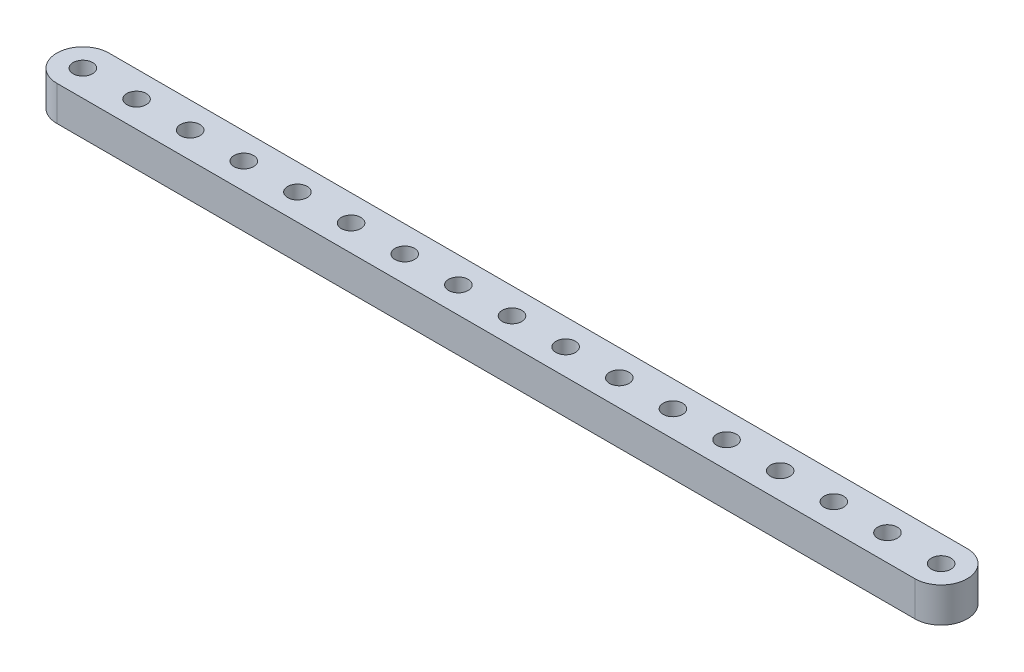
ISO-10303-21;
HEADER;
FILE_DESCRIPTION(('STEP AP214'),'2;1');
FILE_NAME('part.step','',(''),(''),'','','');
FILE_SCHEMA(('AUTOMOTIVE_DESIGN { 1 0 10303 214 1 1 1 1 }'));
ENDSEC;
DATA;
#1=APPLICATION_CONTEXT('core data for automotive mechanical design processes');
#2=APPLICATION_PROTOCOL_DEFINITION('international standard','automotive_design',2000,#1);
#3=PRODUCT_CONTEXT('',#1,'mechanical');
#4=PRODUCT('Part','Part','',(#3));
#5=PRODUCT_RELATED_PRODUCT_CATEGORY('part','',(#4));
#6=PRODUCT_DEFINITION_FORMATION('','',#4);
#7=PRODUCT_DEFINITION_CONTEXT('part definition',#1,'design');
#8=PRODUCT_DEFINITION('design','',#6,#7);
#9=PRODUCT_DEFINITION_SHAPE('','',#8);
#10=(LENGTH_UNIT() NAMED_UNIT(*) SI_UNIT(.MILLI.,.METRE.));
#11=(NAMED_UNIT(*) PLANE_ANGLE_UNIT() SI_UNIT($,.RADIAN.));
#12=(NAMED_UNIT(*) SI_UNIT($,.STERADIAN.) SOLID_ANGLE_UNIT());
#13=UNCERTAINTY_MEASURE_WITH_UNIT(LENGTH_MEASURE(1.E-05),#10,'distance_accuracy_value','');
#14=(GEOMETRIC_REPRESENTATION_CONTEXT(3) GLOBAL_UNCERTAINTY_ASSIGNED_CONTEXT((#13)) GLOBAL_UNIT_ASSIGNED_CONTEXT((#10,
#11,#12)) REPRESENTATION_CONTEXT('',''));
#15=CARTESIAN_POINT('',(0.,0.,0.));
#16=DIRECTION('',(0.,0.,1.));
#17=DIRECTION('',(1.,0.,0.));
#18=AXIS2_PLACEMENT_3D('',#15,#16,#17);
#19=CARTESIAN_POINT('',(78.232,0.,0.));
#20=DIRECTION('',(0.,1.,0.));
#21=DIRECTION('',(0.,0.,1.));
#22=AXIS2_PLACEMENT_3D('',#19,#20,#21);
#23=CYLINDRICAL_SURFACE('',#22,4.76250000000002);
#24=CARTESIAN_POINT('',(78.232,6.35,0.));
#25=DIRECTION('',(0.,1.,0.));
#26=DIRECTION('',(0.,0.,1.));
#27=AXIS2_PLACEMENT_3D('',#24,#25,#26);
#28=CIRCLE('',#27,4.76250000000002);
#29=CARTESIAN_POINT('',(78.232,6.35,4.76250000000002));
#30=VERTEX_POINT('',#29);
#31=CARTESIAN_POINT('',(78.232,6.35,-4.76250000000002));
#32=VERTEX_POINT('',#31);
#33=EDGE_CURVE('E98',#30,#32,#28,.T.);
#34=ORIENTED_EDGE('',*,*,#33,.F.);
#35=DIRECTION('',(0.,1.,0.));
#36=VECTOR('',#35,1.);
#37=CARTESIAN_POINT('',(78.232,0.,4.76250000000002));
#38=LINE('',#37,#36);
#39=CARTESIAN_POINT('',(78.232,0.,4.76250000000002));
#40=VERTEX_POINT('',#39);
#41=EDGE_CURVE('E11',#40,#30,#38,.T.);
#42=ORIENTED_EDGE('',*,*,#41,.F.);
#43=CARTESIAN_POINT('',(78.232,0.,0.));
#44=DIRECTION('',(0.,1.,0.));
#45=DIRECTION('',(0.,0.,1.));
#46=AXIS2_PLACEMENT_3D('',#43,#44,#45);
#47=CIRCLE('',#46,4.76250000000002);
#48=CARTESIAN_POINT('',(78.232,0.,-4.76250000000002));
#49=VERTEX_POINT('',#48);
#50=EDGE_CURVE('E91',#40,#49,#47,.T.);
#51=ORIENTED_EDGE('',*,*,#50,.T.);
#52=DIRECTION('',(0.,1.,0.));
#53=VECTOR('',#52,1.);
#54=CARTESIAN_POINT('',(78.232,0.,-4.76250000000002));
#55=LINE('',#54,#53);
#56=EDGE_CURVE('E36',#49,#32,#55,.T.);
#57=ORIENTED_EDGE('',*,*,#56,.T.);
#58=EDGE_LOOP('',(#34,#42,#51,#57));
#59=FACE_BOUND('',#58,.T.);
#60=ADVANCED_FACE('F33',(#59),#23,.T.);
#61=CARTESIAN_POINT('',(-78.232,0.,4.76250000000002));
#62=DIRECTION('',(0.,0.,1.));
#63=DIRECTION('',(1.,0.,0.));
#64=AXIS2_PLACEMENT_3D('',#61,#62,#63);
#65=PLANE('',#64);
#66=DIRECTION('',(1.,0.,0.));
#67=VECTOR('',#66,1.);
#68=CARTESIAN_POINT('',(-78.232,6.35,4.76250000000002));
#69=LINE('',#68,#67);
#70=CARTESIAN_POINT('',(-78.232,6.35,4.76250000000002));
#71=VERTEX_POINT('',#70);
#72=EDGE_CURVE('E93',#71,#30,#69,.T.);
#73=ORIENTED_EDGE('',*,*,#72,.F.);
#74=DIRECTION('',(0.,1.,0.));
#75=VECTOR('',#74,1.);
#76=CARTESIAN_POINT('',(-78.232,0.,4.76250000000002));
#77=LINE('',#76,#75);
#78=CARTESIAN_POINT('',(-78.232,0.,4.76250000000002));
#79=VERTEX_POINT('',#78);
#80=EDGE_CURVE('E42',#79,#71,#77,.T.);
#81=ORIENTED_EDGE('',*,*,#80,.F.);
#82=DIRECTION('',(1.,0.,0.));
#83=VECTOR('',#82,1.);
#84=CARTESIAN_POINT('',(-78.232,0.,4.76250000000002));
#85=LINE('',#84,#83);
#86=EDGE_CURVE('E88',#79,#40,#85,.T.);
#87=ORIENTED_EDGE('',*,*,#86,.T.);
#88=ORIENTED_EDGE('',*,*,#41,.T.);
#89=EDGE_LOOP('',(#73,#81,#87,#88));
#90=FACE_BOUND('',#89,.T.);
#91=ADVANCED_FACE('F109',(#90),#65,.T.);
#92=CARTESIAN_POINT('',(-78.232,0.,0.));
#93=DIRECTION('',(0.,1.,0.));
#94=DIRECTION('',(0.,0.,1.));
#95=AXIS2_PLACEMENT_3D('',#92,#93,#94);
#96=CYLINDRICAL_SURFACE('',#95,4.76250000000001);
#97=CARTESIAN_POINT('',(-78.232,6.35,0.));
#98=DIRECTION('',(0.,1.,0.));
#99=DIRECTION('',(0.,0.,1.));
#100=AXIS2_PLACEMENT_3D('',#97,#98,#99);
#101=CIRCLE('',#100,4.76250000000001);
#102=CARTESIAN_POINT('',(-78.232,6.35,-4.7625));
#103=VERTEX_POINT('',#102);
#104=EDGE_CURVE('E83',#103,#71,#101,.T.);
#105=ORIENTED_EDGE('',*,*,#104,.F.);
#106=DIRECTION('',(0.,1.,0.));
#107=VECTOR('',#106,1.);
#108=CARTESIAN_POINT('',(-78.232,0.,-4.7625));
#109=LINE('',#108,#107);
#110=CARTESIAN_POINT('',(-78.232,0.,-4.7625));
#111=VERTEX_POINT('',#110);
#112=EDGE_CURVE('E78',#111,#103,#109,.T.);
#113=ORIENTED_EDGE('',*,*,#112,.F.);
#114=CARTESIAN_POINT('',(-78.232,0.,0.));
#115=DIRECTION('',(0.,1.,0.));
#116=DIRECTION('',(0.,0.,1.));
#117=AXIS2_PLACEMENT_3D('',#114,#115,#116);
#118=CIRCLE('',#117,4.76250000000001);
#119=EDGE_CURVE('E81',#111,#79,#118,.T.);
#120=ORIENTED_EDGE('',*,*,#119,.T.);
#121=ORIENTED_EDGE('',*,*,#80,.T.);
#122=EDGE_LOOP('',(#105,#113,#120,#121));
#123=FACE_BOUND('',#122,.T.);
#124=ADVANCED_FACE('F80',(#123),#96,.T.);
#125=CARTESIAN_POINT('',(78.232,0.,-4.76250000000002));
#126=DIRECTION('',(0.,0.,-1.));
#127=DIRECTION('',(-1.,0.,0.));
#128=AXIS2_PLACEMENT_3D('',#125,#126,#127);
#129=PLANE('',#128);
#130=DIRECTION('',(-1.,0.,0.));
#131=VECTOR('',#130,1.);
#132=CARTESIAN_POINT('',(78.232,6.35,-4.76250000000002));
#133=LINE('',#132,#131);
#134=EDGE_CURVE('E101',#32,#103,#133,.T.);
#135=ORIENTED_EDGE('',*,*,#134,.F.);
#136=ORIENTED_EDGE('',*,*,#56,.F.);
#137=DIRECTION('',(-1.,0.,0.));
#138=VECTOR('',#137,1.);
#139=CARTESIAN_POINT('',(78.232,0.,-4.76250000000002));
#140=LINE('',#139,#138);
#141=EDGE_CURVE('E87',#49,#111,#140,.T.);
#142=ORIENTED_EDGE('',*,*,#141,.T.);
#143=ORIENTED_EDGE('',*,*,#112,.T.);
#144=EDGE_LOOP('',(#135,#136,#142,#143));
#145=FACE_BOUND('',#144,.T.);
#146=ADVANCED_FACE('F90',(#145),#129,.T.);
#147=CARTESIAN_POINT('',(78.232,0.,0.));
#148=DIRECTION('',(0.,1.,0.));
#149=DIRECTION('',(0.,0.,1.));
#150=AXIS2_PLACEMENT_3D('',#147,#148,#149);
#151=PLANE('',#150);
#152=CARTESIAN_POINT('',(-78.232,0.,0.));
#153=DIRECTION('',(0.,1.,0.));
#154=DIRECTION('',(0.,0.,-1.));
#155=AXIS2_PLACEMENT_3D('',#152,#153,#154);
#156=CIRCLE('',#155,1.77799999999997);
#157=CARTESIAN_POINT('',(-78.232,0.,-1.77799999999996));
#158=VERTEX_POINT('',#157);
#159=EDGE_CURVE('E202',#158,#158,#156,.T.);
#160=ORIENTED_EDGE('',*,*,#159,.T.);
#161=EDGE_LOOP('',(#160));
#162=FACE_BOUND('',#161,.T.);
#163=CARTESIAN_POINT('',(-68.453,0.,0.));
#164=DIRECTION('',(0.,1.,0.));
#165=DIRECTION('',(0.,0.,-1.));
#166=AXIS2_PLACEMENT_3D('',#163,#164,#165);
#167=CIRCLE('',#166,1.77799999999999);
#168=CARTESIAN_POINT('',(-68.453,0.,-1.77799999999999));
#169=VERTEX_POINT('',#168);
#170=EDGE_CURVE('E210',#169,#169,#167,.T.);
#171=ORIENTED_EDGE('',*,*,#170,.T.);
#172=EDGE_LOOP('',(#171));
#173=FACE_BOUND('',#172,.T.);
#174=CARTESIAN_POINT('',(-58.674,0.,0.));
#175=DIRECTION('',(0.,1.,0.));
#176=DIRECTION('',(0.,0.,-1.));
#177=AXIS2_PLACEMENT_3D('',#174,#175,#176);
#178=CIRCLE('',#177,1.77799999999999);
#179=CARTESIAN_POINT('',(-58.674,0.,-1.77799999999999));
#180=VERTEX_POINT('',#179);
#181=EDGE_CURVE('E216',#180,#180,#178,.T.);
#182=ORIENTED_EDGE('',*,*,#181,.T.);
#183=EDGE_LOOP('',(#182));
#184=FACE_BOUND('',#183,.T.);
#185=CARTESIAN_POINT('',(-48.895,0.,0.));
#186=DIRECTION('',(0.,1.,0.));
#187=DIRECTION('',(0.,0.,-1.));
#188=AXIS2_PLACEMENT_3D('',#185,#186,#187);
#189=CIRCLE('',#188,1.77799999999999);
#190=CARTESIAN_POINT('',(-48.895,0.,-1.77799999999999));
#191=VERTEX_POINT('',#190);
#192=EDGE_CURVE('E222',#191,#191,#189,.T.);
#193=ORIENTED_EDGE('',*,*,#192,.T.);
#194=EDGE_LOOP('',(#193));
#195=FACE_BOUND('',#194,.T.);
#196=CARTESIAN_POINT('',(-39.116,0.,0.));
#197=DIRECTION('',(0.,1.,0.));
#198=DIRECTION('',(0.,0.,-1.));
#199=AXIS2_PLACEMENT_3D('',#196,#197,#198);
#200=CIRCLE('',#199,1.77799999999999);
#201=CARTESIAN_POINT('',(-39.116,0.,-1.77799999999999));
#202=VERTEX_POINT('',#201);
#203=EDGE_CURVE('E228',#202,#202,#200,.T.);
#204=ORIENTED_EDGE('',*,*,#203,.T.);
#205=EDGE_LOOP('',(#204));
#206=FACE_BOUND('',#205,.T.);
#207=CARTESIAN_POINT('',(-29.337,0.,0.));
#208=DIRECTION('',(0.,1.,0.));
#209=DIRECTION('',(0.,0.,-1.));
#210=AXIS2_PLACEMENT_3D('',#207,#208,#209);
#211=CIRCLE('',#210,1.77799999999999);
#212=CARTESIAN_POINT('',(-29.337,0.,-1.77799999999998));
#213=VERTEX_POINT('',#212);
#214=EDGE_CURVE('E234',#213,#213,#211,.T.);
#215=ORIENTED_EDGE('',*,*,#214,.T.);
#216=EDGE_LOOP('',(#215));
#217=FACE_BOUND('',#216,.T.);
#218=CARTESIAN_POINT('',(-19.558,0.,0.));
#219=DIRECTION('',(0.,1.,0.));
#220=DIRECTION('',(0.,0.,-1.));
#221=AXIS2_PLACEMENT_3D('',#218,#219,#220);
#222=CIRCLE('',#221,1.77799999999999);
#223=CARTESIAN_POINT('',(-19.558,0.,-1.77799999999998));
#224=VERTEX_POINT('',#223);
#225=EDGE_CURVE('E240',#224,#224,#222,.T.);
#226=ORIENTED_EDGE('',*,*,#225,.T.);
#227=EDGE_LOOP('',(#226));
#228=FACE_BOUND('',#227,.T.);
#229=CARTESIAN_POINT('',(-9.77900000000001,0.,0.));
#230=DIRECTION('',(0.,1.,0.));
#231=DIRECTION('',(0.,0.,-1.));
#232=AXIS2_PLACEMENT_3D('',#229,#230,#231);
#233=CIRCLE('',#232,1.77799999999999);
#234=CARTESIAN_POINT('',(-9.77900000000001,0.,-1.77799999999998));
#235=VERTEX_POINT('',#234);
#236=EDGE_CURVE('E246',#235,#235,#233,.T.);
#237=ORIENTED_EDGE('',*,*,#236,.T.);
#238=EDGE_LOOP('',(#237));
#239=FACE_BOUND('',#238,.T.);
#240=CARTESIAN_POINT('',(0.,0.,0.));
#241=DIRECTION('',(0.,1.,0.));
#242=DIRECTION('',(0.,0.,-1.));
#243=AXIS2_PLACEMENT_3D('',#240,#241,#242);
#244=CIRCLE('',#243,1.77799999999999);
#245=CARTESIAN_POINT('',(0.,0.,-1.77799999999998));
#246=VERTEX_POINT('',#245);
#247=EDGE_CURVE('E252',#246,#246,#244,.T.);
#248=ORIENTED_EDGE('',*,*,#247,.T.);
#249=EDGE_LOOP('',(#248));
#250=FACE_BOUND('',#249,.T.);
#251=CARTESIAN_POINT('',(9.77899999999998,0.,0.));
#252=DIRECTION('',(0.,1.,0.));
#253=DIRECTION('',(0.,0.,-1.));
#254=AXIS2_PLACEMENT_3D('',#251,#252,#253);
#255=CIRCLE('',#254,1.77799999999999);
#256=CARTESIAN_POINT('',(9.77899999999998,0.,-1.77799999999998));
#257=VERTEX_POINT('',#256);
#258=EDGE_CURVE('E258',#257,#257,#255,.T.);
#259=ORIENTED_EDGE('',*,*,#258,.T.);
#260=EDGE_LOOP('',(#259));
#261=FACE_BOUND('',#260,.T.);
#262=CARTESIAN_POINT('',(19.558,0.,0.));
#263=DIRECTION('',(0.,1.,0.));
#264=DIRECTION('',(0.,0.,-1.));
#265=AXIS2_PLACEMENT_3D('',#262,#263,#264);
#266=CIRCLE('',#265,1.77799999999999);
#267=CARTESIAN_POINT('',(19.558,0.,-1.77799999999998));
#268=VERTEX_POINT('',#267);
#269=EDGE_CURVE('E264',#268,#268,#266,.T.);
#270=ORIENTED_EDGE('',*,*,#269,.T.);
#271=EDGE_LOOP('',(#270));
#272=FACE_BOUND('',#271,.T.);
#273=CARTESIAN_POINT('',(29.337,0.,0.));
#274=DIRECTION('',(0.,1.,0.));
#275=DIRECTION('',(0.,0.,-1.));
#276=AXIS2_PLACEMENT_3D('',#273,#274,#275);
#277=CIRCLE('',#276,1.77799999999999);
#278=CARTESIAN_POINT('',(29.337,0.,-1.77799999999998));
#279=VERTEX_POINT('',#278);
#280=EDGE_CURVE('E270',#279,#279,#277,.T.);
#281=ORIENTED_EDGE('',*,*,#280,.T.);
#282=EDGE_LOOP('',(#281));
#283=FACE_BOUND('',#282,.T.);
#284=CARTESIAN_POINT('',(39.116,0.,0.));
#285=DIRECTION('',(0.,1.,0.));
#286=DIRECTION('',(0.,0.,-1.));
#287=AXIS2_PLACEMENT_3D('',#284,#285,#286);
#288=CIRCLE('',#287,1.77799999999999);
#289=CARTESIAN_POINT('',(39.116,0.,-1.77799999999998));
#290=VERTEX_POINT('',#289);
#291=EDGE_CURVE('E276',#290,#290,#288,.T.);
#292=ORIENTED_EDGE('',*,*,#291,.T.);
#293=EDGE_LOOP('',(#292));
#294=FACE_BOUND('',#293,.T.);
#295=CARTESIAN_POINT('',(48.895,0.,0.));
#296=DIRECTION('',(0.,1.,0.));
#297=DIRECTION('',(0.,0.,-1.));
#298=AXIS2_PLACEMENT_3D('',#295,#296,#297);
#299=CIRCLE('',#298,1.77799999999999);
#300=CARTESIAN_POINT('',(48.895,0.,-1.77799999999998));
#301=VERTEX_POINT('',#300);
#302=EDGE_CURVE('E282',#301,#301,#299,.T.);
#303=ORIENTED_EDGE('',*,*,#302,.T.);
#304=EDGE_LOOP('',(#303));
#305=FACE_BOUND('',#304,.T.);
#306=CARTESIAN_POINT('',(58.674,0.,0.));
#307=DIRECTION('',(0.,1.,0.));
#308=DIRECTION('',(0.,0.,-1.));
#309=AXIS2_PLACEMENT_3D('',#306,#307,#308);
#310=CIRCLE('',#309,1.77799999999999);
#311=CARTESIAN_POINT('',(58.674,0.,-1.77799999999998));
#312=VERTEX_POINT('',#311);
#313=EDGE_CURVE('E288',#312,#312,#310,.T.);
#314=ORIENTED_EDGE('',*,*,#313,.T.);
#315=EDGE_LOOP('',(#314));
#316=FACE_BOUND('',#315,.T.);
#317=CARTESIAN_POINT('',(68.453,0.,0.));
#318=DIRECTION('',(0.,1.,0.));
#319=DIRECTION('',(0.,0.,-1.));
#320=AXIS2_PLACEMENT_3D('',#317,#318,#319);
#321=CIRCLE('',#320,1.77799999999999);
#322=CARTESIAN_POINT('',(68.453,0.,-1.77799999999997));
#323=VERTEX_POINT('',#322);
#324=EDGE_CURVE('E294',#323,#323,#321,.T.);
#325=ORIENTED_EDGE('',*,*,#324,.T.);
#326=EDGE_LOOP('',(#325));
#327=FACE_BOUND('',#326,.T.);
#328=CARTESIAN_POINT('',(78.232,0.,0.));
#329=DIRECTION('',(0.,1.,0.));
#330=DIRECTION('',(0.,0.,-1.));
#331=AXIS2_PLACEMENT_3D('',#328,#329,#330);
#332=CIRCLE('',#331,1.77799999999999);
#333=CARTESIAN_POINT('',(78.232,0.,-1.77799999999997));
#334=VERTEX_POINT('',#333);
#335=EDGE_CURVE('E102',#334,#334,#332,.T.);
#336=ORIENTED_EDGE('',*,*,#335,.T.);
#337=EDGE_LOOP('',(#336));
#338=FACE_BOUND('',#337,.T.);
#339=ORIENTED_EDGE('',*,*,#50,.F.);
#340=ORIENTED_EDGE('',*,*,#86,.F.);
#341=ORIENTED_EDGE('',*,*,#119,.F.);
#342=ORIENTED_EDGE('',*,*,#141,.F.);
#343=EDGE_LOOP('',(#339,#340,#341,#342));
#344=FACE_BOUND('',#343,.T.);
#345=ADVANCED_FACE('F86',(#162,#173,#184,#195,#206,#217,#228,#239,#250,#261,#272,#283,#294,#305,
#316,#327,#338,#344),#151,.F.);
#346=CARTESIAN_POINT('',(78.232,6.35,0.));
#347=DIRECTION('',(0.,1.,0.));
#348=DIRECTION('',(0.,0.,1.));
#349=AXIS2_PLACEMENT_3D('',#346,#347,#348);
#350=PLANE('',#349);
#351=CARTESIAN_POINT('',(-78.232,6.35,0.));
#352=DIRECTION('',(0.,1.,0.));
#353=DIRECTION('',(0.,0.,-1.));
#354=AXIS2_PLACEMENT_3D('',#351,#352,#353);
#355=CIRCLE('',#354,1.77799999999997);
#356=CARTESIAN_POINT('',(-78.232,6.35,-1.77799999999996));
#357=VERTEX_POINT('',#356);
#358=EDGE_CURVE('E205',#357,#357,#355,.T.);
#359=ORIENTED_EDGE('',*,*,#358,.F.);
#360=EDGE_LOOP('',(#359));
#361=FACE_BOUND('',#360,.T.);
#362=CARTESIAN_POINT('',(-68.453,6.35,0.));
#363=DIRECTION('',(0.,1.,0.));
#364=DIRECTION('',(0.,0.,-1.));
#365=AXIS2_PLACEMENT_3D('',#362,#363,#364);
#366=CIRCLE('',#365,1.77799999999999);
#367=CARTESIAN_POINT('',(-68.453,6.35,-1.77799999999999));
#368=VERTEX_POINT('',#367);
#369=EDGE_CURVE('E207',#368,#368,#366,.T.);
#370=ORIENTED_EDGE('',*,*,#369,.F.);
#371=EDGE_LOOP('',(#370));
#372=FACE_BOUND('',#371,.T.);
#373=CARTESIAN_POINT('',(-58.674,6.35,0.));
#374=DIRECTION('',(0.,1.,0.));
#375=DIRECTION('',(0.,0.,-1.));
#376=AXIS2_PLACEMENT_3D('',#373,#374,#375);
#377=CIRCLE('',#376,1.77799999999999);
#378=CARTESIAN_POINT('',(-58.674,6.35,-1.77799999999999));
#379=VERTEX_POINT('',#378);
#380=EDGE_CURVE('E213',#379,#379,#377,.T.);
#381=ORIENTED_EDGE('',*,*,#380,.F.);
#382=EDGE_LOOP('',(#381));
#383=FACE_BOUND('',#382,.T.);
#384=CARTESIAN_POINT('',(-48.895,6.35,0.));
#385=DIRECTION('',(0.,1.,0.));
#386=DIRECTION('',(0.,0.,-1.));
#387=AXIS2_PLACEMENT_3D('',#384,#385,#386);
#388=CIRCLE('',#387,1.77799999999999);
#389=CARTESIAN_POINT('',(-48.895,6.35,-1.77799999999999));
#390=VERTEX_POINT('',#389);
#391=EDGE_CURVE('E219',#390,#390,#388,.T.);
#392=ORIENTED_EDGE('',*,*,#391,.F.);
#393=EDGE_LOOP('',(#392));
#394=FACE_BOUND('',#393,.T.);
#395=CARTESIAN_POINT('',(-39.116,6.35,0.));
#396=DIRECTION('',(0.,1.,0.));
#397=DIRECTION('',(0.,0.,-1.));
#398=AXIS2_PLACEMENT_3D('',#395,#396,#397);
#399=CIRCLE('',#398,1.77799999999999);
#400=CARTESIAN_POINT('',(-39.116,6.35,-1.77799999999999));
#401=VERTEX_POINT('',#400);
#402=EDGE_CURVE('E225',#401,#401,#399,.T.);
#403=ORIENTED_EDGE('',*,*,#402,.F.);
#404=EDGE_LOOP('',(#403));
#405=FACE_BOUND('',#404,.T.);
#406=CARTESIAN_POINT('',(-29.337,6.35,0.));
#407=DIRECTION('',(0.,1.,0.));
#408=DIRECTION('',(0.,0.,-1.));
#409=AXIS2_PLACEMENT_3D('',#406,#407,#408);
#410=CIRCLE('',#409,1.77799999999999);
#411=CARTESIAN_POINT('',(-29.337,6.35,-1.77799999999998));
#412=VERTEX_POINT('',#411);
#413=EDGE_CURVE('E231',#412,#412,#410,.T.);
#414=ORIENTED_EDGE('',*,*,#413,.F.);
#415=EDGE_LOOP('',(#414));
#416=FACE_BOUND('',#415,.T.);
#417=CARTESIAN_POINT('',(-19.558,6.35,0.));
#418=DIRECTION('',(0.,1.,0.));
#419=DIRECTION('',(0.,0.,-1.));
#420=AXIS2_PLACEMENT_3D('',#417,#418,#419);
#421=CIRCLE('',#420,1.77799999999999);
#422=CARTESIAN_POINT('',(-19.558,6.35,-1.77799999999998));
#423=VERTEX_POINT('',#422);
#424=EDGE_CURVE('E237',#423,#423,#421,.T.);
#425=ORIENTED_EDGE('',*,*,#424,.F.);
#426=EDGE_LOOP('',(#425));
#427=FACE_BOUND('',#426,.T.);
#428=CARTESIAN_POINT('',(-9.77900000000001,6.35,0.));
#429=DIRECTION('',(0.,1.,0.));
#430=DIRECTION('',(0.,0.,-1.));
#431=AXIS2_PLACEMENT_3D('',#428,#429,#430);
#432=CIRCLE('',#431,1.77799999999999);
#433=CARTESIAN_POINT('',(-9.77900000000001,6.35,-1.77799999999998));
#434=VERTEX_POINT('',#433);
#435=EDGE_CURVE('E243',#434,#434,#432,.T.);
#436=ORIENTED_EDGE('',*,*,#435,.F.);
#437=EDGE_LOOP('',(#436));
#438=FACE_BOUND('',#437,.T.);
#439=CARTESIAN_POINT('',(0.,6.35,0.));
#440=DIRECTION('',(0.,1.,0.));
#441=DIRECTION('',(0.,0.,-1.));
#442=AXIS2_PLACEMENT_3D('',#439,#440,#441);
#443=CIRCLE('',#442,1.77799999999999);
#444=CARTESIAN_POINT('',(0.,6.35,-1.77799999999998));
#445=VERTEX_POINT('',#444);
#446=EDGE_CURVE('E249',#445,#445,#443,.T.);
#447=ORIENTED_EDGE('',*,*,#446,.F.);
#448=EDGE_LOOP('',(#447));
#449=FACE_BOUND('',#448,.T.);
#450=CARTESIAN_POINT('',(9.77899999999998,6.35,0.));
#451=DIRECTION('',(0.,1.,0.));
#452=DIRECTION('',(0.,0.,-1.));
#453=AXIS2_PLACEMENT_3D('',#450,#451,#452);
#454=CIRCLE('',#453,1.77799999999999);
#455=CARTESIAN_POINT('',(9.77899999999998,6.35,-1.77799999999998));
#456=VERTEX_POINT('',#455);
#457=EDGE_CURVE('E255',#456,#456,#454,.T.);
#458=ORIENTED_EDGE('',*,*,#457,.F.);
#459=EDGE_LOOP('',(#458));
#460=FACE_BOUND('',#459,.T.);
#461=CARTESIAN_POINT('',(19.558,6.35,0.));
#462=DIRECTION('',(0.,1.,0.));
#463=DIRECTION('',(0.,0.,-1.));
#464=AXIS2_PLACEMENT_3D('',#461,#462,#463);
#465=CIRCLE('',#464,1.77799999999999);
#466=CARTESIAN_POINT('',(19.558,6.35,-1.77799999999998));
#467=VERTEX_POINT('',#466);
#468=EDGE_CURVE('E261',#467,#467,#465,.T.);
#469=ORIENTED_EDGE('',*,*,#468,.F.);
#470=EDGE_LOOP('',(#469));
#471=FACE_BOUND('',#470,.T.);
#472=CARTESIAN_POINT('',(29.337,6.35,0.));
#473=DIRECTION('',(0.,1.,0.));
#474=DIRECTION('',(0.,0.,-1.));
#475=AXIS2_PLACEMENT_3D('',#472,#473,#474);
#476=CIRCLE('',#475,1.77799999999999);
#477=CARTESIAN_POINT('',(29.337,6.35,-1.77799999999998));
#478=VERTEX_POINT('',#477);
#479=EDGE_CURVE('E267',#478,#478,#476,.T.);
#480=ORIENTED_EDGE('',*,*,#479,.F.);
#481=EDGE_LOOP('',(#480));
#482=FACE_BOUND('',#481,.T.);
#483=CARTESIAN_POINT('',(39.116,6.35,0.));
#484=DIRECTION('',(0.,1.,0.));
#485=DIRECTION('',(0.,0.,-1.));
#486=AXIS2_PLACEMENT_3D('',#483,#484,#485);
#487=CIRCLE('',#486,1.77799999999999);
#488=CARTESIAN_POINT('',(39.116,6.35,-1.77799999999998));
#489=VERTEX_POINT('',#488);
#490=EDGE_CURVE('E273',#489,#489,#487,.T.);
#491=ORIENTED_EDGE('',*,*,#490,.F.);
#492=EDGE_LOOP('',(#491));
#493=FACE_BOUND('',#492,.T.);
#494=CARTESIAN_POINT('',(48.895,6.35,0.));
#495=DIRECTION('',(0.,1.,0.));
#496=DIRECTION('',(0.,0.,-1.));
#497=AXIS2_PLACEMENT_3D('',#494,#495,#496);
#498=CIRCLE('',#497,1.77799999999999);
#499=CARTESIAN_POINT('',(48.895,6.35,-1.77799999999998));
#500=VERTEX_POINT('',#499);
#501=EDGE_CURVE('E279',#500,#500,#498,.T.);
#502=ORIENTED_EDGE('',*,*,#501,.F.);
#503=EDGE_LOOP('',(#502));
#504=FACE_BOUND('',#503,.T.);
#505=CARTESIAN_POINT('',(58.674,6.35,0.));
#506=DIRECTION('',(0.,1.,0.));
#507=DIRECTION('',(0.,0.,-1.));
#508=AXIS2_PLACEMENT_3D('',#505,#506,#507);
#509=CIRCLE('',#508,1.77799999999999);
#510=CARTESIAN_POINT('',(58.674,6.35,-1.77799999999998));
#511=VERTEX_POINT('',#510);
#512=EDGE_CURVE('E285',#511,#511,#509,.T.);
#513=ORIENTED_EDGE('',*,*,#512,.F.);
#514=EDGE_LOOP('',(#513));
#515=FACE_BOUND('',#514,.T.);
#516=CARTESIAN_POINT('',(68.453,6.35,0.));
#517=DIRECTION('',(0.,1.,0.));
#518=DIRECTION('',(0.,0.,-1.));
#519=AXIS2_PLACEMENT_3D('',#516,#517,#518);
#520=CIRCLE('',#519,1.77799999999999);
#521=CARTESIAN_POINT('',(68.453,6.35,-1.77799999999997));
#522=VERTEX_POINT('',#521);
#523=EDGE_CURVE('E291',#522,#522,#520,.T.);
#524=ORIENTED_EDGE('',*,*,#523,.F.);
#525=EDGE_LOOP('',(#524));
#526=FACE_BOUND('',#525,.T.);
#527=CARTESIAN_POINT('',(78.232,6.35,0.));
#528=DIRECTION('',(0.,1.,0.));
#529=DIRECTION('',(0.,0.,-1.));
#530=AXIS2_PLACEMENT_3D('',#527,#528,#529);
#531=CIRCLE('',#530,1.77799999999999);
#532=CARTESIAN_POINT('',(78.232,6.35,-1.77799999999997));
#533=VERTEX_POINT('',#532);
#534=EDGE_CURVE('E297',#533,#533,#531,.T.);
#535=ORIENTED_EDGE('',*,*,#534,.F.);
#536=EDGE_LOOP('',(#535));
#537=FACE_BOUND('',#536,.T.);
#538=ORIENTED_EDGE('',*,*,#33,.T.);
#539=ORIENTED_EDGE('',*,*,#134,.T.);
#540=ORIENTED_EDGE('',*,*,#104,.T.);
#541=ORIENTED_EDGE('',*,*,#72,.T.);
#542=EDGE_LOOP('',(#538,#539,#540,#541));
#543=FACE_BOUND('',#542,.T.);
#544=ADVANCED_FACE('F108',(#361,#372,#383,#394,#405,#416,#427,#438,#449,#460,#471,#482,#493,
#504,#515,#526,#537,#543),#350,.T.);
#545=CARTESIAN_POINT('',(78.232,0.,0.));
#546=DIRECTION('',(0.,1.,0.));
#547=DIRECTION('',(0.,0.,1.));
#548=AXIS2_PLACEMENT_3D('',#545,#546,#547);
#549=CYLINDRICAL_SURFACE('',#548,1.77799999999999);
#550=ORIENTED_EDGE('',*,*,#335,.F.);
#551=EDGE_LOOP('',(#550));
#552=FACE_BOUND('',#551,.T.);
#553=ORIENTED_EDGE('',*,*,#534,.T.);
#554=EDGE_LOOP('',(#553));
#555=FACE_BOUND('',#554,.T.);
#556=ADVANCED_FACE('F127',(#552,#555),#549,.F.);
#557=CARTESIAN_POINT('',(68.453,0.,0.));
#558=DIRECTION('',(0.,1.,0.));
#559=DIRECTION('',(0.,0.,1.));
#560=AXIS2_PLACEMENT_3D('',#557,#558,#559);
#561=CYLINDRICAL_SURFACE('',#560,1.77799999999999);
#562=ORIENTED_EDGE('',*,*,#324,.F.);
#563=EDGE_LOOP('',(#562));
#564=FACE_BOUND('',#563,.T.);
#565=ORIENTED_EDGE('',*,*,#523,.T.);
#566=EDGE_LOOP('',(#565));
#567=FACE_BOUND('',#566,.T.);
#568=ADVANCED_FACE('F134',(#564,#567),#561,.F.);
#569=CARTESIAN_POINT('',(58.674,0.,0.));
#570=DIRECTION('',(0.,1.,0.));
#571=DIRECTION('',(0.,0.,1.));
#572=AXIS2_PLACEMENT_3D('',#569,#570,#571);
#573=CYLINDRICAL_SURFACE('',#572,1.77799999999999);
#574=ORIENTED_EDGE('',*,*,#313,.F.);
#575=EDGE_LOOP('',(#574));
#576=FACE_BOUND('',#575,.T.);
#577=ORIENTED_EDGE('',*,*,#512,.T.);
#578=EDGE_LOOP('',(#577));
#579=FACE_BOUND('',#578,.T.);
#580=ADVANCED_FACE('F138',(#576,#579),#573,.F.);
#581=CARTESIAN_POINT('',(48.895,0.,0.));
#582=DIRECTION('',(0.,1.,0.));
#583=DIRECTION('',(0.,0.,1.));
#584=AXIS2_PLACEMENT_3D('',#581,#582,#583);
#585=CYLINDRICAL_SURFACE('',#584,1.77799999999999);
#586=ORIENTED_EDGE('',*,*,#302,.F.);
#587=EDGE_LOOP('',(#586));
#588=FACE_BOUND('',#587,.T.);
#589=ORIENTED_EDGE('',*,*,#501,.T.);
#590=EDGE_LOOP('',(#589));
#591=FACE_BOUND('',#590,.T.);
#592=ADVANCED_FACE('F142',(#588,#591),#585,.F.);
#593=CARTESIAN_POINT('',(39.116,0.,0.));
#594=DIRECTION('',(0.,1.,0.));
#595=DIRECTION('',(0.,0.,1.));
#596=AXIS2_PLACEMENT_3D('',#593,#594,#595);
#597=CYLINDRICAL_SURFACE('',#596,1.77799999999999);
#598=ORIENTED_EDGE('',*,*,#291,.F.);
#599=EDGE_LOOP('',(#598));
#600=FACE_BOUND('',#599,.T.);
#601=ORIENTED_EDGE('',*,*,#490,.T.);
#602=EDGE_LOOP('',(#601));
#603=FACE_BOUND('',#602,.T.);
#604=ADVANCED_FACE('F146',(#600,#603),#597,.F.);
#605=CARTESIAN_POINT('',(29.337,0.,0.));
#606=DIRECTION('',(0.,1.,0.));
#607=DIRECTION('',(0.,0.,1.));
#608=AXIS2_PLACEMENT_3D('',#605,#606,#607);
#609=CYLINDRICAL_SURFACE('',#608,1.77799999999999);
#610=ORIENTED_EDGE('',*,*,#280,.F.);
#611=EDGE_LOOP('',(#610));
#612=FACE_BOUND('',#611,.T.);
#613=ORIENTED_EDGE('',*,*,#479,.T.);
#614=EDGE_LOOP('',(#613));
#615=FACE_BOUND('',#614,.T.);
#616=ADVANCED_FACE('F150',(#612,#615),#609,.F.);
#617=CARTESIAN_POINT('',(19.558,0.,0.));
#618=DIRECTION('',(0.,1.,0.));
#619=DIRECTION('',(0.,0.,1.));
#620=AXIS2_PLACEMENT_3D('',#617,#618,#619);
#621=CYLINDRICAL_SURFACE('',#620,1.77799999999999);
#622=ORIENTED_EDGE('',*,*,#269,.F.);
#623=EDGE_LOOP('',(#622));
#624=FACE_BOUND('',#623,.T.);
#625=ORIENTED_EDGE('',*,*,#468,.T.);
#626=EDGE_LOOP('',(#625));
#627=FACE_BOUND('',#626,.T.);
#628=ADVANCED_FACE('F154',(#624,#627),#621,.F.);
#629=CARTESIAN_POINT('',(9.77899999999998,0.,0.));
#630=DIRECTION('',(0.,1.,0.));
#631=DIRECTION('',(0.,0.,1.));
#632=AXIS2_PLACEMENT_3D('',#629,#630,#631);
#633=CYLINDRICAL_SURFACE('',#632,1.77799999999999);
#634=ORIENTED_EDGE('',*,*,#258,.F.);
#635=EDGE_LOOP('',(#634));
#636=FACE_BOUND('',#635,.T.);
#637=ORIENTED_EDGE('',*,*,#457,.T.);
#638=EDGE_LOOP('',(#637));
#639=FACE_BOUND('',#638,.T.);
#640=ADVANCED_FACE('F158',(#636,#639),#633,.F.);
#641=CARTESIAN_POINT('',(0.,0.,0.));
#642=DIRECTION('',(0.,1.,0.));
#643=DIRECTION('',(0.,0.,1.));
#644=AXIS2_PLACEMENT_3D('',#641,#642,#643);
#645=CYLINDRICAL_SURFACE('',#644,1.77799999999999);
#646=ORIENTED_EDGE('',*,*,#247,.F.);
#647=EDGE_LOOP('',(#646));
#648=FACE_BOUND('',#647,.T.);
#649=ORIENTED_EDGE('',*,*,#446,.T.);
#650=EDGE_LOOP('',(#649));
#651=FACE_BOUND('',#650,.T.);
#652=ADVANCED_FACE('F162',(#648,#651),#645,.F.);
#653=CARTESIAN_POINT('',(-9.77900000000001,0.,0.));
#654=DIRECTION('',(0.,1.,0.));
#655=DIRECTION('',(0.,0.,1.));
#656=AXIS2_PLACEMENT_3D('',#653,#654,#655);
#657=CYLINDRICAL_SURFACE('',#656,1.77799999999999);
#658=ORIENTED_EDGE('',*,*,#236,.F.);
#659=EDGE_LOOP('',(#658));
#660=FACE_BOUND('',#659,.T.);
#661=ORIENTED_EDGE('',*,*,#435,.T.);
#662=EDGE_LOOP('',(#661));
#663=FACE_BOUND('',#662,.T.);
#664=ADVANCED_FACE('F166',(#660,#663),#657,.F.);
#665=CARTESIAN_POINT('',(-19.558,0.,0.));
#666=DIRECTION('',(0.,1.,0.));
#667=DIRECTION('',(0.,0.,1.));
#668=AXIS2_PLACEMENT_3D('',#665,#666,#667);
#669=CYLINDRICAL_SURFACE('',#668,1.77799999999999);
#670=ORIENTED_EDGE('',*,*,#225,.F.);
#671=EDGE_LOOP('',(#670));
#672=FACE_BOUND('',#671,.T.);
#673=ORIENTED_EDGE('',*,*,#424,.T.);
#674=EDGE_LOOP('',(#673));
#675=FACE_BOUND('',#674,.T.);
#676=ADVANCED_FACE('F170',(#672,#675),#669,.F.);
#677=CARTESIAN_POINT('',(-29.337,0.,0.));
#678=DIRECTION('',(0.,1.,0.));
#679=DIRECTION('',(0.,0.,1.));
#680=AXIS2_PLACEMENT_3D('',#677,#678,#679);
#681=CYLINDRICAL_SURFACE('',#680,1.77799999999999);
#682=ORIENTED_EDGE('',*,*,#214,.F.);
#683=EDGE_LOOP('',(#682));
#684=FACE_BOUND('',#683,.T.);
#685=ORIENTED_EDGE('',*,*,#413,.T.);
#686=EDGE_LOOP('',(#685));
#687=FACE_BOUND('',#686,.T.);
#688=ADVANCED_FACE('F174',(#684,#687),#681,.F.);
#689=CARTESIAN_POINT('',(-39.116,0.,0.));
#690=DIRECTION('',(0.,1.,0.));
#691=DIRECTION('',(0.,0.,1.));
#692=AXIS2_PLACEMENT_3D('',#689,#690,#691);
#693=CYLINDRICAL_SURFACE('',#692,1.77799999999999);
#694=ORIENTED_EDGE('',*,*,#203,.F.);
#695=EDGE_LOOP('',(#694));
#696=FACE_BOUND('',#695,.T.);
#697=ORIENTED_EDGE('',*,*,#402,.T.);
#698=EDGE_LOOP('',(#697));
#699=FACE_BOUND('',#698,.T.);
#700=ADVANCED_FACE('F178',(#696,#699),#693,.F.);
#701=CARTESIAN_POINT('',(-48.895,0.,0.));
#702=DIRECTION('',(0.,1.,0.));
#703=DIRECTION('',(0.,0.,1.));
#704=AXIS2_PLACEMENT_3D('',#701,#702,#703);
#705=CYLINDRICAL_SURFACE('',#704,1.77799999999999);
#706=ORIENTED_EDGE('',*,*,#192,.F.);
#707=EDGE_LOOP('',(#706));
#708=FACE_BOUND('',#707,.T.);
#709=ORIENTED_EDGE('',*,*,#391,.T.);
#710=EDGE_LOOP('',(#709));
#711=FACE_BOUND('',#710,.T.);
#712=ADVANCED_FACE('F182',(#708,#711),#705,.F.);
#713=CARTESIAN_POINT('',(-58.674,0.,0.));
#714=DIRECTION('',(0.,1.,0.));
#715=DIRECTION('',(0.,0.,1.));
#716=AXIS2_PLACEMENT_3D('',#713,#714,#715);
#717=CYLINDRICAL_SURFACE('',#716,1.77799999999999);
#718=ORIENTED_EDGE('',*,*,#181,.F.);
#719=EDGE_LOOP('',(#718));
#720=FACE_BOUND('',#719,.T.);
#721=ORIENTED_EDGE('',*,*,#380,.T.);
#722=EDGE_LOOP('',(#721));
#723=FACE_BOUND('',#722,.T.);
#724=ADVANCED_FACE('F186',(#720,#723),#717,.F.);
#725=CARTESIAN_POINT('',(-68.453,0.,0.));
#726=DIRECTION('',(0.,1.,0.));
#727=DIRECTION('',(0.,0.,1.));
#728=AXIS2_PLACEMENT_3D('',#725,#726,#727);
#729=CYLINDRICAL_SURFACE('',#728,1.77799999999999);
#730=ORIENTED_EDGE('',*,*,#170,.F.);
#731=EDGE_LOOP('',(#730));
#732=FACE_BOUND('',#731,.T.);
#733=ORIENTED_EDGE('',*,*,#369,.T.);
#734=EDGE_LOOP('',(#733));
#735=FACE_BOUND('',#734,.T.);
#736=ADVANCED_FACE('F190',(#732,#735),#729,.F.);
#737=CARTESIAN_POINT('',(-78.232,0.,0.));
#738=DIRECTION('',(0.,1.,0.));
#739=DIRECTION('',(0.,0.,1.));
#740=AXIS2_PLACEMENT_3D('',#737,#738,#739);
#741=CYLINDRICAL_SURFACE('',#740,1.77799999999997);
#742=ORIENTED_EDGE('',*,*,#159,.F.);
#743=EDGE_LOOP('',(#742));
#744=FACE_BOUND('',#743,.T.);
#745=ORIENTED_EDGE('',*,*,#358,.T.);
#746=EDGE_LOOP('',(#745));
#747=FACE_BOUND('',#746,.T.);
#748=ADVANCED_FACE('F194',(#744,#747),#741,.F.);
#749=CLOSED_SHELL('',(#60,#91,#124,#146,#345,#544,#556,#568,#580,#592,#604,#616,#628,#640,#652,
#664,#676,#688,#700,#712,#724,#736,#748));
#750=MANIFOLD_SOLID_BREP('B2',#749);
#751=ADVANCED_BREP_SHAPE_REPRESENTATION('',(#18,#750),#14);
#752=SHAPE_DEFINITION_REPRESENTATION(#9,#751);
ENDSEC;
END-ISO-10303-21;
